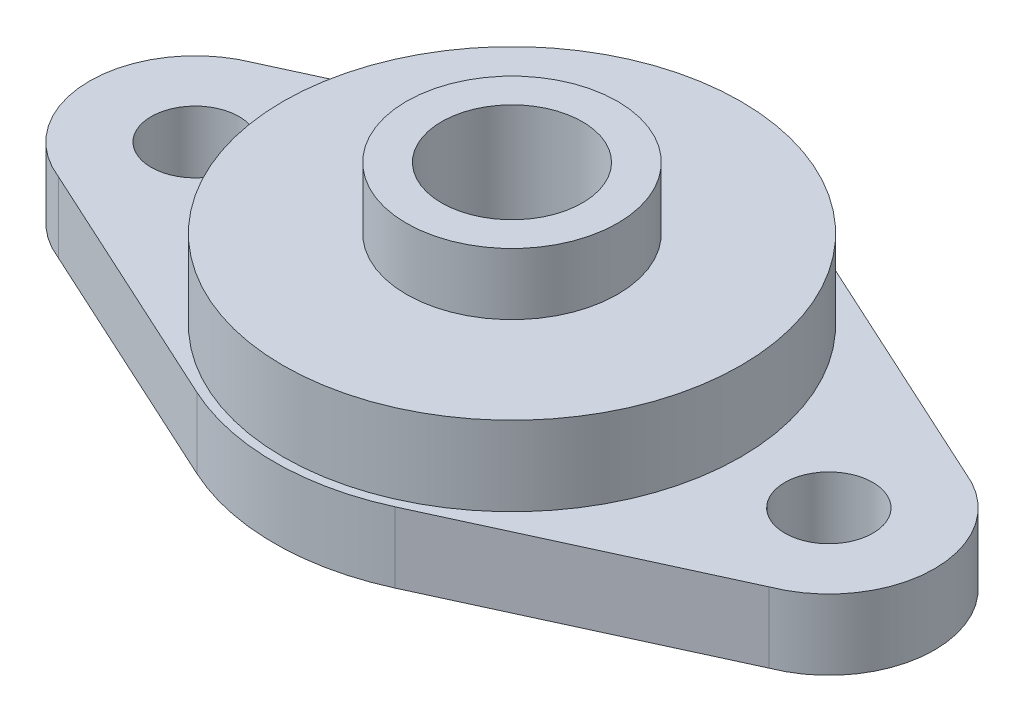
ISO-10303-21;
HEADER;
FILE_DESCRIPTION(('STEP AP214'),'2;1');
FILE_NAME('part.step','',(''),(''),'','','');
FILE_SCHEMA(('AUTOMOTIVE_DESIGN { 1 0 10303 214 1 1 1 1 }'));
ENDSEC;
DATA;
#1=APPLICATION_CONTEXT('core data for automotive mechanical design processes');
#2=APPLICATION_PROTOCOL_DEFINITION('international standard','automotive_design',2000,#1);
#3=PRODUCT_CONTEXT('',#1,'mechanical');
#4=PRODUCT('Part','Part','',(#3));
#5=PRODUCT_RELATED_PRODUCT_CATEGORY('part','',(#4));
#6=PRODUCT_DEFINITION_FORMATION('','',#4);
#7=PRODUCT_DEFINITION_CONTEXT('part definition',#1,'design');
#8=PRODUCT_DEFINITION('design','',#6,#7);
#9=PRODUCT_DEFINITION_SHAPE('','',#8);
#10=(LENGTH_UNIT() NAMED_UNIT(*) SI_UNIT(.MILLI.,.METRE.));
#11=(NAMED_UNIT(*) PLANE_ANGLE_UNIT() SI_UNIT($,.RADIAN.));
#12=(NAMED_UNIT(*) SI_UNIT($,.STERADIAN.) SOLID_ANGLE_UNIT());
#13=UNCERTAINTY_MEASURE_WITH_UNIT(LENGTH_MEASURE(1.E-05),#10,'distance_accuracy_value','');
#14=(GEOMETRIC_REPRESENTATION_CONTEXT(3) GLOBAL_UNCERTAINTY_ASSIGNED_CONTEXT((#13)) GLOBAL_UNIT_ASSIGNED_CONTEXT((#10,
#11,#12)) REPRESENTATION_CONTEXT('',''));
#15=CARTESIAN_POINT('',(0.,0.,0.));
#16=DIRECTION('',(0.,0.,1.));
#17=DIRECTION('',(1.,0.,0.));
#18=AXIS2_PLACEMENT_3D('',#15,#16,#17);
#19=CARTESIAN_POINT('',(0.,8.5,0.));
#20=DIRECTION('',(0.,1.,0.));
#21=DIRECTION('',(0.,0.,1.));
#22=AXIS2_PLACEMENT_3D('',#19,#20,#21);
#23=PLANE('',#22);
#24=CARTESIAN_POINT('',(0.,8.5,0.));
#25=DIRECTION('',(0.,1.,0.));
#26=DIRECTION('',(0.,0.,1.));
#27=AXIS2_PLACEMENT_3D('',#24,#25,#26);
#28=CIRCLE('',#27,13.);
#29=CARTESIAN_POINT('',(0.,8.5,13.));
#30=VERTEX_POINT('',#29);
#31=EDGE_CURVE('E193',#30,#30,#28,.T.);
#32=ORIENTED_EDGE('',*,*,#31,.T.);
#33=EDGE_LOOP('',(#32));
#34=FACE_BOUND('',#33,.T.);
#35=CARTESIAN_POINT('',(0.,8.5,0.));
#36=DIRECTION('',(0.,1.,0.));
#37=DIRECTION('',(0.,0.,1.));
#38=AXIS2_PLACEMENT_3D('',#35,#36,#37);
#39=CIRCLE('',#38,6.);
#40=CARTESIAN_POINT('',(0.,8.5,6.));
#41=VERTEX_POINT('',#40);
#42=EDGE_CURVE('E202',#41,#41,#39,.T.);
#43=ORIENTED_EDGE('',*,*,#42,.F.);
#44=EDGE_LOOP('',(#43));
#45=FACE_BOUND('',#44,.T.);
#46=ADVANCED_FACE('F34',(#34,#45),#23,.T.);
#47=CARTESIAN_POINT('',(0.,4.,0.));
#48=DIRECTION('',(0.,1.,0.));
#49=DIRECTION('',(0.,0.,1.));
#50=AXIS2_PLACEMENT_3D('',#47,#48,#49);
#51=PLANE('',#50);
#52=CARTESIAN_POINT('',(-18.,4.,0.));
#53=DIRECTION('',(0.,1.,0.));
#54=DIRECTION('',(0.,0.,1.));
#55=AXIS2_PLACEMENT_3D('',#52,#53,#54);
#56=CIRCLE('',#55,2.49999999999995);
#57=CARTESIAN_POINT('',(-18.,4.,2.49999999999995));
#58=VERTEX_POINT('',#57);
#59=EDGE_CURVE('E187',#58,#58,#56,.T.);
#60=ORIENTED_EDGE('',*,*,#59,.F.);
#61=EDGE_LOOP('',(#60));
#62=FACE_BOUND('',#61,.T.);
#63=CARTESIAN_POINT('',(0.,4.,0.));
#64=DIRECTION('',(0.,1.,0.));
#65=DIRECTION('',(0.,0.,1.));
#66=AXIS2_PLACEMENT_3D('',#63,#64,#65);
#67=CIRCLE('',#66,13.5);
#68=CARTESIAN_POINT('',(5.63225670701373,4.,-12.2689724258513));
#69=VERTEX_POINT('',#68);
#70=CARTESIAN_POINT('',(-5.63225670701351,4.,-12.2689724258513));
#71=VERTEX_POINT('',#70);
#72=EDGE_CURVE('E147',#69,#71,#67,.T.);
#73=ORIENTED_EDGE('',*,*,#72,.T.);
#74=DIRECTION('',(-0.90881277228529,0.,0.417204200519513));
#75=VECTOR('',#74,1.);
#76=CARTESIAN_POINT('',(-20.1896397507528,4.,-5.58618633433605));
#77=LINE('',#76,#75);
#78=CARTESIAN_POINT('',(-20.1896397507528,4.,-5.58618633433603));
#79=VERTEX_POINT('',#78);
#80=EDGE_CURVE('E94',#71,#79,#77,.T.);
#81=ORIENTED_EDGE('',*,*,#80,.T.);
#82=CARTESIAN_POINT('',(-18.,4.,0.));
#83=DIRECTION('',(0.,1.,0.));
#84=DIRECTION('',(0.,0.,1.));
#85=AXIS2_PLACEMENT_3D('',#82,#83,#84);
#86=CIRCLE('',#85,5.99999999999995);
#87=CARTESIAN_POINT('',(-20.1896397507502,4.,5.58618633433705));
#88=VERTEX_POINT('',#87);
#89=EDGE_CURVE('E162',#79,#88,#86,.T.);
#90=ORIENTED_EDGE('',*,*,#89,.T.);
#91=DIRECTION('',(0.908812772285281,0.,0.417204200519531));
#92=VECTOR('',#91,1.);
#93=CARTESIAN_POINT('',(-20.1896397507502,4.,5.58618633433705));
#94=LINE('',#93,#92);
#95=CARTESIAN_POINT('',(-5.6322567070133,4.,12.2689724258516));
#96=VERTEX_POINT('',#95);
#97=EDGE_CURVE('E175',#88,#96,#94,.T.);
#98=ORIENTED_EDGE('',*,*,#97,.T.);
#99=CARTESIAN_POINT('',(0.,4.,0.));
#100=DIRECTION('',(0.,1.,0.));
#101=DIRECTION('',(0.,0.,1.));
#102=AXIS2_PLACEMENT_3D('',#99,#100,#101);
#103=CIRCLE('',#102,13.5000000000001);
#104=CARTESIAN_POINT('',(5.63225670701373,4.,12.2689724258515));
#105=VERTEX_POINT('',#104);
#106=EDGE_CURVE('E114',#96,#105,#103,.T.);
#107=ORIENTED_EDGE('',*,*,#106,.T.);
#108=DIRECTION('',(0.908812772285284,0.,-0.417204200519526));
#109=VECTOR('',#108,1.);
#110=CARTESIAN_POINT('',(20.1896397507511,4.,5.58618633433683));
#111=LINE('',#110,#109);
#112=CARTESIAN_POINT('',(20.1896397507511,4.,5.58618633433685));
#113=VERTEX_POINT('',#112);
#114=EDGE_CURVE('E107',#105,#113,#111,.T.);
#115=ORIENTED_EDGE('',*,*,#114,.T.);
#116=CARTESIAN_POINT('',(18.,4.,0.));
#117=DIRECTION('',(0.,1.,0.));
#118=DIRECTION('',(0.,0.,1.));
#119=AXIS2_PLACEMENT_3D('',#116,#117,#118);
#120=CIRCLE('',#119,6.00000000000007);
#121=CARTESIAN_POINT('',(20.1896397507517,4.,-5.58618633433661));
#122=VERTEX_POINT('',#121);
#123=EDGE_CURVE('E112',#113,#122,#120,.T.);
#124=ORIENTED_EDGE('',*,*,#123,.T.);
#125=DIRECTION('',(-0.908812772285288,0.,-0.417204200519516));
#126=VECTOR('',#125,1.);
#127=CARTESIAN_POINT('',(20.1896397507517,4.,-5.58618633433661));
#128=LINE('',#127,#126);
#129=EDGE_CURVE('E51',#122,#69,#128,.T.);
#130=ORIENTED_EDGE('',*,*,#129,.T.);
#131=EDGE_LOOP('',(#73,#81,#90,#98,#107,#115,#124,#130));
#132=FACE_BOUND('',#131,.T.);
#133=CARTESIAN_POINT('',(18.,4.,0.));
#134=DIRECTION('',(0.,1.,0.));
#135=DIRECTION('',(0.,0.,1.));
#136=AXIS2_PLACEMENT_3D('',#133,#134,#135);
#137=CIRCLE('',#136,2.49999999999995);
#138=CARTESIAN_POINT('',(18.,4.,2.49999999999995));
#139=VERTEX_POINT('',#138);
#140=EDGE_CURVE('E183',#139,#139,#137,.T.);
#141=ORIENTED_EDGE('',*,*,#140,.F.);
#142=EDGE_LOOP('',(#141));
#143=FACE_BOUND('',#142,.T.);
#144=CARTESIAN_POINT('',(0.,4.,0.));
#145=DIRECTION('',(0.,1.,0.));
#146=DIRECTION('',(0.,0.,1.));
#147=AXIS2_PLACEMENT_3D('',#144,#145,#146);
#148=CIRCLE('',#147,13.);
#149=CARTESIAN_POINT('',(0.,4.,13.));
#150=VERTEX_POINT('',#149);
#151=EDGE_CURVE('E196',#150,#150,#148,.T.);
#152=ORIENTED_EDGE('',*,*,#151,.F.);
#153=EDGE_LOOP('',(#152));
#154=FACE_BOUND('',#153,.T.);
#155=ADVANCED_FACE('F109',(#62,#132,#143,#154),#51,.T.);
#156=CARTESIAN_POINT('',(0.,0.,0.));
#157=DIRECTION('',(0.,1.,0.));
#158=DIRECTION('',(0.,0.,1.));
#159=AXIS2_PLACEMENT_3D('',#156,#157,#158);
#160=PLANE('',#159);
#161=CARTESIAN_POINT('',(0.,0.,0.));
#162=DIRECTION('',(0.,1.,0.));
#163=DIRECTION('',(0.,0.,1.));
#164=AXIS2_PLACEMENT_3D('',#161,#162,#163);
#165=CIRCLE('',#164,13.5);
#166=CARTESIAN_POINT('',(5.63225670701373,0.,-12.2689724258513));
#167=VERTEX_POINT('',#166);
#168=CARTESIAN_POINT('',(-5.63225670701351,0.,-12.2689724258513));
#169=VERTEX_POINT('',#168);
#170=EDGE_CURVE('E132',#167,#169,#165,.T.);
#171=ORIENTED_EDGE('',*,*,#170,.F.);
#172=DIRECTION('',(-0.908812772285288,0.,-0.417204200519516));
#173=VECTOR('',#172,1.);
#174=CARTESIAN_POINT('',(20.1896397507517,0.,-5.58618633433661));
#175=LINE('',#174,#173);
#176=CARTESIAN_POINT('',(20.1896397507517,0.,-5.58618633433661));
#177=VERTEX_POINT('',#176);
#178=EDGE_CURVE('E86',#177,#167,#175,.T.);
#179=ORIENTED_EDGE('',*,*,#178,.F.);
#180=CARTESIAN_POINT('',(18.,0.,0.));
#181=DIRECTION('',(0.,1.,0.));
#182=DIRECTION('',(0.,0.,1.));
#183=AXIS2_PLACEMENT_3D('',#180,#181,#182);
#184=CIRCLE('',#183,6.00000000000007);
#185=CARTESIAN_POINT('',(20.1896397507511,0.,5.58618633433685));
#186=VERTEX_POINT('',#185);
#187=EDGE_CURVE('E80',#186,#177,#184,.T.);
#188=ORIENTED_EDGE('',*,*,#187,.F.);
#189=DIRECTION('',(0.908812772285284,0.,-0.417204200519526));
#190=VECTOR('',#189,1.);
#191=CARTESIAN_POINT('',(20.1896397507511,0.,5.58618633433683));
#192=LINE('',#191,#190);
#193=CARTESIAN_POINT('',(5.63225670701373,0.,12.2689724258515));
#194=VERTEX_POINT('',#193);
#195=EDGE_CURVE('E122',#194,#186,#192,.T.);
#196=ORIENTED_EDGE('',*,*,#195,.F.);
#197=CARTESIAN_POINT('',(0.,0.,0.));
#198=DIRECTION('',(0.,1.,0.));
#199=DIRECTION('',(0.,0.,1.));
#200=AXIS2_PLACEMENT_3D('',#197,#198,#199);
#201=CIRCLE('',#200,13.5000000000001);
#202=CARTESIAN_POINT('',(-5.6322567070133,0.,12.2689724258516));
#203=VERTEX_POINT('',#202);
#204=EDGE_CURVE('E142',#203,#194,#201,.T.);
#205=ORIENTED_EDGE('',*,*,#204,.F.);
#206=DIRECTION('',(0.908812772285281,0.,0.417204200519531));
#207=VECTOR('',#206,1.);
#208=CARTESIAN_POINT('',(-20.1896397507502,0.,5.58618633433705));
#209=LINE('',#208,#207);
#210=CARTESIAN_POINT('',(-20.1896397507502,0.,5.58618633433705));
#211=VERTEX_POINT('',#210);
#212=EDGE_CURVE('E140',#211,#203,#209,.T.);
#213=ORIENTED_EDGE('',*,*,#212,.F.);
#214=CARTESIAN_POINT('',(-18.,0.,0.));
#215=DIRECTION('',(0.,1.,0.));
#216=DIRECTION('',(0.,0.,1.));
#217=AXIS2_PLACEMENT_3D('',#214,#215,#216);
#218=CIRCLE('',#217,5.99999999999995);
#219=CARTESIAN_POINT('',(-20.1896397507528,0.,-5.58618633433603));
#220=VERTEX_POINT('',#219);
#221=EDGE_CURVE('E138',#220,#211,#218,.T.);
#222=ORIENTED_EDGE('',*,*,#221,.F.);
#223=DIRECTION('',(-0.90881277228529,0.,0.417204200519513));
#224=VECTOR('',#223,1.);
#225=CARTESIAN_POINT('',(-20.1896397507528,0.,-5.58618633433605));
#226=LINE('',#225,#224);
#227=EDGE_CURVE('E135',#169,#220,#226,.T.);
#228=ORIENTED_EDGE('',*,*,#227,.F.);
#229=EDGE_LOOP('',(#171,#179,#188,#196,#205,#213,#222,#228));
#230=FACE_BOUND('',#229,.T.);
#231=CARTESIAN_POINT('',(0.,0.,0.));
#232=DIRECTION('',(0.,1.,0.));
#233=DIRECTION('',(0.,0.,1.));
#234=AXIS2_PLACEMENT_3D('',#231,#232,#233);
#235=CIRCLE('',#234,4.);
#236=CARTESIAN_POINT('',(0.,0.,4.));
#237=VERTEX_POINT('',#236);
#238=EDGE_CURVE('E136',#237,#237,#235,.T.);
#239=ORIENTED_EDGE('',*,*,#238,.T.);
#240=EDGE_LOOP('',(#239));
#241=FACE_BOUND('',#240,.T.);
#242=CARTESIAN_POINT('',(18.,0.,0.));
#243=DIRECTION('',(0.,1.,0.));
#244=DIRECTION('',(0.,0.,1.));
#245=AXIS2_PLACEMENT_3D('',#242,#243,#244);
#246=CIRCLE('',#245,2.49999999999995);
#247=CARTESIAN_POINT('',(18.,0.,2.49999999999995));
#248=VERTEX_POINT('',#247);
#249=EDGE_CURVE('E184',#248,#248,#246,.T.);
#250=ORIENTED_EDGE('',*,*,#249,.T.);
#251=EDGE_LOOP('',(#250));
#252=FACE_BOUND('',#251,.T.);
#253=CARTESIAN_POINT('',(-18.,0.,0.));
#254=DIRECTION('',(0.,1.,0.));
#255=DIRECTION('',(0.,0.,1.));
#256=AXIS2_PLACEMENT_3D('',#253,#254,#255);
#257=CIRCLE('',#256,2.49999999999995);
#258=CARTESIAN_POINT('',(-18.,0.,2.49999999999995));
#259=VERTEX_POINT('',#258);
#260=EDGE_CURVE('E190',#259,#259,#257,.T.);
#261=ORIENTED_EDGE('',*,*,#260,.T.);
#262=EDGE_LOOP('',(#261));
#263=FACE_BOUND('',#262,.T.);
#264=ADVANCED_FACE('F166',(#230,#241,#252,#263),#160,.F.);
#265=CARTESIAN_POINT('',(0.,4.,0.));
#266=DIRECTION('',(0.,-1.,0.));
#267=DIRECTION('',(0.,0.,-1.));
#268=AXIS2_PLACEMENT_3D('',#265,#266,#267);
#269=CYLINDRICAL_SURFACE('',#268,13.5);
#270=ORIENTED_EDGE('',*,*,#170,.T.);
#271=DIRECTION('',(0.,-1.,0.));
#272=VECTOR('',#271,1.);
#273=CARTESIAN_POINT('',(-5.63225670701351,4.,-12.2689724258513));
#274=LINE('',#273,#272);
#275=EDGE_CURVE('E11',#71,#169,#274,.T.);
#276=ORIENTED_EDGE('',*,*,#275,.F.);
#277=ORIENTED_EDGE('',*,*,#72,.F.);
#278=DIRECTION('',(0.,-1.,0.));
#279=VECTOR('',#278,1.);
#280=CARTESIAN_POINT('',(5.63225670701373,4.,-12.2689724258513));
#281=LINE('',#280,#279);
#282=EDGE_CURVE('E128',#69,#167,#281,.T.);
#283=ORIENTED_EDGE('',*,*,#282,.T.);
#284=EDGE_LOOP('',(#270,#276,#277,#283));
#285=FACE_BOUND('',#284,.T.);
#286=ADVANCED_FACE('F36',(#285),#269,.T.);
#287=CARTESIAN_POINT('',(-20.1896397507528,4.,-5.58618633433605));
#288=DIRECTION('',(0.417204200519513,0.,0.90881277228529));
#289=DIRECTION('',(0.90881277228529,0.,-0.417204200519513));
#290=AXIS2_PLACEMENT_3D('',#287,#288,#289);
#291=PLANE('',#290);
#292=ORIENTED_EDGE('',*,*,#227,.T.);
#293=DIRECTION('',(0.,-1.,0.));
#294=VECTOR('',#293,1.);
#295=CARTESIAN_POINT('',(-20.1896397507528,4.,-5.58618633433603));
#296=LINE('',#295,#294);
#297=EDGE_CURVE('E43',#79,#220,#296,.T.);
#298=ORIENTED_EDGE('',*,*,#297,.F.);
#299=ORIENTED_EDGE('',*,*,#80,.F.);
#300=ORIENTED_EDGE('',*,*,#275,.T.);
#301=EDGE_LOOP('',(#292,#298,#299,#300));
#302=FACE_BOUND('',#301,.T.);
#303=ADVANCED_FACE('F262',(#302),#291,.F.);
#304=CARTESIAN_POINT('',(-18.,4.,0.));
#305=DIRECTION('',(0.,-1.,0.));
#306=DIRECTION('',(0.,0.,-1.));
#307=AXIS2_PLACEMENT_3D('',#304,#305,#306);
#308=CYLINDRICAL_SURFACE('',#307,5.99999999999995);
#309=ORIENTED_EDGE('',*,*,#221,.T.);
#310=DIRECTION('',(0.,-1.,0.));
#311=VECTOR('',#310,1.);
#312=CARTESIAN_POINT('',(-20.1896397507502,4.,5.58618633433705));
#313=LINE('',#312,#311);
#314=EDGE_CURVE('E154',#88,#211,#313,.T.);
#315=ORIENTED_EDGE('',*,*,#314,.F.);
#316=ORIENTED_EDGE('',*,*,#89,.F.);
#317=ORIENTED_EDGE('',*,*,#297,.T.);
#318=EDGE_LOOP('',(#309,#315,#316,#317));
#319=FACE_BOUND('',#318,.T.);
#320=ADVANCED_FACE('F160',(#319),#308,.T.);
#321=CARTESIAN_POINT('',(-20.1896397507502,4.,5.58618633433705));
#322=DIRECTION('',(0.417204200519531,0.,-0.908812772285282));
#323=DIRECTION('',(-0.908812772285282,0.,-0.417204200519531));
#324=AXIS2_PLACEMENT_3D('',#321,#322,#323);
#325=PLANE('',#324);
#326=ORIENTED_EDGE('',*,*,#212,.T.);
#327=DIRECTION('',(0.,-1.,0.));
#328=VECTOR('',#327,1.);
#329=CARTESIAN_POINT('',(-5.6322567070133,4.,12.2689724258516));
#330=LINE('',#329,#328);
#331=EDGE_CURVE('E151',#96,#203,#330,.T.);
#332=ORIENTED_EDGE('',*,*,#331,.F.);
#333=ORIENTED_EDGE('',*,*,#97,.F.);
#334=ORIENTED_EDGE('',*,*,#314,.T.);
#335=EDGE_LOOP('',(#326,#332,#333,#334));
#336=FACE_BOUND('',#335,.T.);
#337=ADVANCED_FACE('F171',(#336),#325,.F.);
#338=CARTESIAN_POINT('',(0.,4.,0.));
#339=DIRECTION('',(0.,-1.,0.));
#340=DIRECTION('',(0.,0.,-1.));
#341=AXIS2_PLACEMENT_3D('',#338,#339,#340);
#342=CYLINDRICAL_SURFACE('',#341,13.5000000000001);
#343=ORIENTED_EDGE('',*,*,#204,.T.);
#344=DIRECTION('',(0.,-1.,0.));
#345=VECTOR('',#344,1.);
#346=CARTESIAN_POINT('',(5.63225670701373,4.,12.2689724258515));
#347=LINE('',#346,#345);
#348=EDGE_CURVE('E123',#105,#194,#347,.T.);
#349=ORIENTED_EDGE('',*,*,#348,.F.);
#350=ORIENTED_EDGE('',*,*,#106,.F.);
#351=ORIENTED_EDGE('',*,*,#331,.T.);
#352=EDGE_LOOP('',(#343,#349,#350,#351));
#353=FACE_BOUND('',#352,.T.);
#354=ADVANCED_FACE('F174',(#353),#342,.T.);
#355=CARTESIAN_POINT('',(20.1896397507511,4.,5.58618633433683));
#356=DIRECTION('',(-0.417204200519526,0.,-0.908812772285284));
#357=DIRECTION('',(-0.908812772285284,0.,0.417204200519526));
#358=AXIS2_PLACEMENT_3D('',#355,#356,#357);
#359=PLANE('',#358);
#360=ORIENTED_EDGE('',*,*,#195,.T.);
#361=DIRECTION('',(0.,-1.,0.));
#362=VECTOR('',#361,1.);
#363=CARTESIAN_POINT('',(20.1896397507511,4.,5.58618633433685));
#364=LINE('',#363,#362);
#365=EDGE_CURVE('E119',#113,#186,#364,.T.);
#366=ORIENTED_EDGE('',*,*,#365,.F.);
#367=ORIENTED_EDGE('',*,*,#114,.F.);
#368=ORIENTED_EDGE('',*,*,#348,.T.);
#369=EDGE_LOOP('',(#360,#366,#367,#368));
#370=FACE_BOUND('',#369,.T.);
#371=ADVANCED_FACE('F120',(#370),#359,.F.);
#372=CARTESIAN_POINT('',(18.,4.,0.));
#373=DIRECTION('',(0.,-1.,0.));
#374=DIRECTION('',(0.,0.,-1.));
#375=AXIS2_PLACEMENT_3D('',#372,#373,#374);
#376=CYLINDRICAL_SURFACE('',#375,6.00000000000007);
#377=ORIENTED_EDGE('',*,*,#187,.T.);
#378=DIRECTION('',(0.,-1.,0.));
#379=VECTOR('',#378,1.);
#380=CARTESIAN_POINT('',(20.1896397507517,4.,-5.58618633433661));
#381=LINE('',#380,#379);
#382=EDGE_CURVE('E124',#122,#177,#381,.T.);
#383=ORIENTED_EDGE('',*,*,#382,.F.);
#384=ORIENTED_EDGE('',*,*,#123,.F.);
#385=ORIENTED_EDGE('',*,*,#365,.T.);
#386=EDGE_LOOP('',(#377,#383,#384,#385));
#387=FACE_BOUND('',#386,.T.);
#388=ADVANCED_FACE('F126',(#387),#376,.T.);
#389=CARTESIAN_POINT('',(20.1896397507517,4.,-5.58618633433661));
#390=DIRECTION('',(-0.417204200519516,0.,0.908812772285288));
#391=DIRECTION('',(0.908812772285288,0.,0.417204200519516));
#392=AXIS2_PLACEMENT_3D('',#389,#390,#391);
#393=PLANE('',#392);
#394=ORIENTED_EDGE('',*,*,#178,.T.);
#395=ORIENTED_EDGE('',*,*,#282,.F.);
#396=ORIENTED_EDGE('',*,*,#129,.F.);
#397=ORIENTED_EDGE('',*,*,#382,.T.);
#398=EDGE_LOOP('',(#394,#395,#396,#397));
#399=FACE_BOUND('',#398,.T.);
#400=ADVANCED_FACE('F246',(#399),#393,.F.);
#401=CARTESIAN_POINT('',(0.,4.,0.));
#402=DIRECTION('',(0.,-1.,0.));
#403=DIRECTION('',(0.,0.,-1.));
#404=AXIS2_PLACEMENT_3D('',#401,#402,#403);
#405=CYLINDRICAL_SURFACE('',#404,4.);
#406=ORIENTED_EDGE('',*,*,#238,.F.);
#407=EDGE_LOOP('',(#406));
#408=FACE_BOUND('',#407,.T.);
#409=CARTESIAN_POINT('',(0.,12.,0.));
#410=DIRECTION('',(0.,1.,0.));
#411=DIRECTION('',(0.,0.,1.));
#412=AXIS2_PLACEMENT_3D('',#409,#410,#411);
#413=CIRCLE('',#412,4.);
#414=CARTESIAN_POINT('',(0.,12.,4.));
#415=VERTEX_POINT('',#414);
#416=EDGE_CURVE('E205',#415,#415,#413,.T.);
#417=ORIENTED_EDGE('',*,*,#416,.T.);
#418=EDGE_LOOP('',(#417));
#419=FACE_BOUND('',#418,.T.);
#420=ADVANCED_FACE('F211',(#408,#419),#405,.F.);
#421=CARTESIAN_POINT('',(18.,4.,0.));
#422=DIRECTION('',(0.,-1.,0.));
#423=DIRECTION('',(0.,0.,-1.));
#424=AXIS2_PLACEMENT_3D('',#421,#422,#423);
#425=CYLINDRICAL_SURFACE('',#424,2.49999999999995);
#426=ORIENTED_EDGE('',*,*,#140,.T.);
#427=EDGE_LOOP('',(#426));
#428=FACE_BOUND('',#427,.T.);
#429=ORIENTED_EDGE('',*,*,#249,.F.);
#430=EDGE_LOOP('',(#429));
#431=FACE_BOUND('',#430,.T.);
#432=ADVANCED_FACE('F240',(#428,#431),#425,.F.);
#433=CARTESIAN_POINT('',(-18.,4.,0.));
#434=DIRECTION('',(0.,-1.,0.));
#435=DIRECTION('',(0.,0.,-1.));
#436=AXIS2_PLACEMENT_3D('',#433,#434,#435);
#437=CYLINDRICAL_SURFACE('',#436,2.49999999999995);
#438=ORIENTED_EDGE('',*,*,#59,.T.);
#439=EDGE_LOOP('',(#438));
#440=FACE_BOUND('',#439,.T.);
#441=ORIENTED_EDGE('',*,*,#260,.F.);
#442=EDGE_LOOP('',(#441));
#443=FACE_BOUND('',#442,.T.);
#444=ADVANCED_FACE('F225',(#440,#443),#437,.F.);
#445=CARTESIAN_POINT('',(0.,8.5,0.));
#446=DIRECTION('',(0.,-1.,0.));
#447=DIRECTION('',(0.,0.,-1.));
#448=AXIS2_PLACEMENT_3D('',#445,#446,#447);
#449=CYLINDRICAL_SURFACE('',#448,13.);
#450=ORIENTED_EDGE('',*,*,#31,.F.);
#451=EDGE_LOOP('',(#450));
#452=FACE_BOUND('',#451,.T.);
#453=ORIENTED_EDGE('',*,*,#151,.T.);
#454=EDGE_LOOP('',(#453));
#455=FACE_BOUND('',#454,.T.);
#456=ADVANCED_FACE('F216',(#452,#455),#449,.T.);
#457=CARTESIAN_POINT('',(0.,12.,0.));
#458=DIRECTION('',(0.,1.,0.));
#459=DIRECTION('',(0.,0.,1.));
#460=AXIS2_PLACEMENT_3D('',#457,#458,#459);
#461=PLANE('',#460);
#462=CARTESIAN_POINT('',(0.,12.,0.));
#463=DIRECTION('',(0.,1.,0.));
#464=DIRECTION('',(0.,0.,1.));
#465=AXIS2_PLACEMENT_3D('',#462,#463,#464);
#466=CIRCLE('',#465,6.);
#467=CARTESIAN_POINT('',(0.,12.,6.));
#468=VERTEX_POINT('',#467);
#469=EDGE_CURVE('E199',#468,#468,#466,.T.);
#470=ORIENTED_EDGE('',*,*,#469,.T.);
#471=EDGE_LOOP('',(#470));
#472=FACE_BOUND('',#471,.T.);
#473=ORIENTED_EDGE('',*,*,#416,.F.);
#474=EDGE_LOOP('',(#473));
#475=FACE_BOUND('',#474,.T.);
#476=ADVANCED_FACE('F213',(#472,#475),#461,.T.);
#477=CARTESIAN_POINT('',(0.,12.,0.));
#478=DIRECTION('',(0.,-1.,0.));
#479=DIRECTION('',(0.,0.,-1.));
#480=AXIS2_PLACEMENT_3D('',#477,#478,#479);
#481=CYLINDRICAL_SURFACE('',#480,6.);
#482=ORIENTED_EDGE('',*,*,#469,.F.);
#483=EDGE_LOOP('',(#482));
#484=FACE_BOUND('',#483,.T.);
#485=ORIENTED_EDGE('',*,*,#42,.T.);
#486=EDGE_LOOP('',(#485));
#487=FACE_BOUND('',#486,.T.);
#488=ADVANCED_FACE('F215',(#484,#487),#481,.T.);
#489=CLOSED_SHELL('',(#46,#155,#264,#286,#303,#320,#337,#354,#371,#388,#400,#420,#432,#444,#456,
#476,#488));
#490=MANIFOLD_SOLID_BREP('B2',#489);
#491=ADVANCED_BREP_SHAPE_REPRESENTATION('',(#18,#490),#14);
#492=SHAPE_DEFINITION_REPRESENTATION(#9,#491);
ENDSEC;
END-ISO-10303-21;
